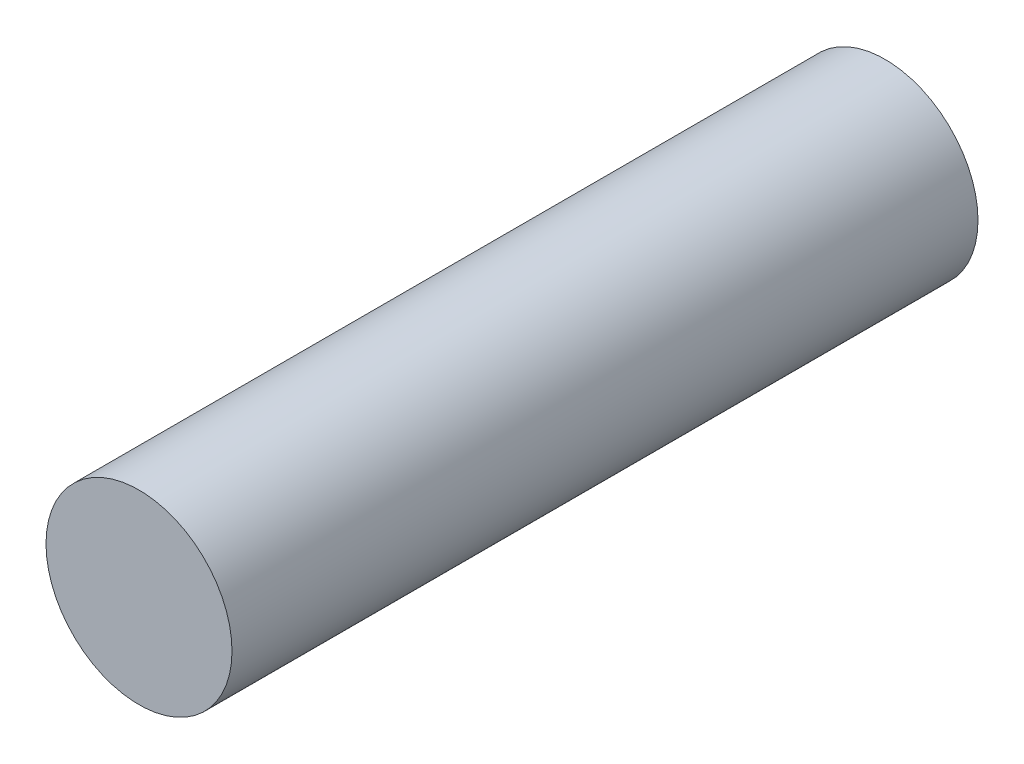
ISO-10303-21;
HEADER;
FILE_DESCRIPTION(('STEP AP214'),'2;1');
FILE_NAME('part.step','',(''),(''),'','','');
FILE_SCHEMA(('AUTOMOTIVE_DESIGN { 1 0 10303 214 1 1 1 1 }'));
ENDSEC;
DATA;
#1=APPLICATION_CONTEXT('core data for automotive mechanical design processes');
#2=APPLICATION_PROTOCOL_DEFINITION('international standard','automotive_design',2000,#1);
#3=PRODUCT_CONTEXT('',#1,'mechanical');
#4=PRODUCT('Part','Part','',(#3));
#5=PRODUCT_RELATED_PRODUCT_CATEGORY('part','',(#4));
#6=PRODUCT_DEFINITION_FORMATION('','',#4);
#7=PRODUCT_DEFINITION_CONTEXT('part definition',#1,'design');
#8=PRODUCT_DEFINITION('design','',#6,#7);
#9=PRODUCT_DEFINITION_SHAPE('','',#8);
#10=(LENGTH_UNIT() NAMED_UNIT(*) SI_UNIT(.MILLI.,.METRE.));
#11=(NAMED_UNIT(*) PLANE_ANGLE_UNIT() SI_UNIT($,.RADIAN.));
#12=(NAMED_UNIT(*) SI_UNIT($,.STERADIAN.) SOLID_ANGLE_UNIT());
#13=UNCERTAINTY_MEASURE_WITH_UNIT(LENGTH_MEASURE(1.E-05),#10,'distance_accuracy_value','');
#14=(GEOMETRIC_REPRESENTATION_CONTEXT(3) GLOBAL_UNCERTAINTY_ASSIGNED_CONTEXT((#13)) GLOBAL_UNIT_ASSIGNED_CONTEXT((#10,
#11,#12)) REPRESENTATION_CONTEXT('',''));
#15=CARTESIAN_POINT('',(0.,0.,0.));
#16=DIRECTION('',(0.,0.,1.));
#17=DIRECTION('',(1.,0.,0.));
#18=AXIS2_PLACEMENT_3D('',#15,#16,#17);
#19=CARTESIAN_POINT('',(0.,0.,19.05));
#20=DIRECTION('',(0.,0.,-1.));
#21=DIRECTION('',(-1.,0.,0.));
#22=AXIS2_PLACEMENT_3D('',#19,#20,#21);
#23=CYLINDRICAL_SURFACE('',#22,2.3749);
#24=CARTESIAN_POINT('',(0.,0.,19.05));
#25=DIRECTION('',(0.,0.,1.));
#26=DIRECTION('',(1.,0.,0.));
#27=AXIS2_PLACEMENT_3D('',#24,#25,#26);
#28=CIRCLE('',#27,2.3749);
#29=CARTESIAN_POINT('',(2.3749,0.,19.05));
#30=VERTEX_POINT('',#29);
#31=EDGE_CURVE('E10',#30,#30,#28,.T.);
#32=ORIENTED_EDGE('',*,*,#31,.F.);
#33=EDGE_LOOP('',(#32));
#34=FACE_BOUND('',#33,.T.);
#35=CARTESIAN_POINT('',(0.,0.,0.));
#36=DIRECTION('',(0.,0.,1.));
#37=DIRECTION('',(1.,0.,0.));
#38=AXIS2_PLACEMENT_3D('',#35,#36,#37);
#39=CIRCLE('',#38,2.3749);
#40=CARTESIAN_POINT('',(2.3749,0.,0.));
#41=VERTEX_POINT('',#40);
#42=EDGE_CURVE('E34',#41,#41,#39,.T.);
#43=ORIENTED_EDGE('',*,*,#42,.T.);
#44=EDGE_LOOP('',(#43));
#45=FACE_BOUND('',#44,.T.);
#46=ADVANCED_FACE('F31',(#34,#45),#23,.T.);
#47=CARTESIAN_POINT('',(0.,0.,19.05));
#48=DIRECTION('',(0.,0.,1.));
#49=DIRECTION('',(1.,0.,0.));
#50=AXIS2_PLACEMENT_3D('',#47,#48,#49);
#51=PLANE('',#50);
#52=ORIENTED_EDGE('',*,*,#31,.T.);
#53=EDGE_LOOP('',(#52));
#54=FACE_BOUND('',#53,.T.);
#55=ADVANCED_FACE('F46',(#54),#51,.T.);
#56=CARTESIAN_POINT('',(0.,0.,0.));
#57=DIRECTION('',(0.,0.,1.));
#58=DIRECTION('',(1.,0.,0.));
#59=AXIS2_PLACEMENT_3D('',#56,#57,#58);
#60=PLANE('',#59);
#61=ORIENTED_EDGE('',*,*,#42,.F.);
#62=EDGE_LOOP('',(#61));
#63=FACE_BOUND('',#62,.T.);
#64=ADVANCED_FACE('F44',(#63),#60,.F.);
#65=CLOSED_SHELL('',(#46,#55,#64));
#66=MANIFOLD_SOLID_BREP('B2',#65);
#67=ADVANCED_BREP_SHAPE_REPRESENTATION('',(#18,#66),#14);
#68=SHAPE_DEFINITION_REPRESENTATION(#9,#67);
ENDSEC;
END-ISO-10303-21;
